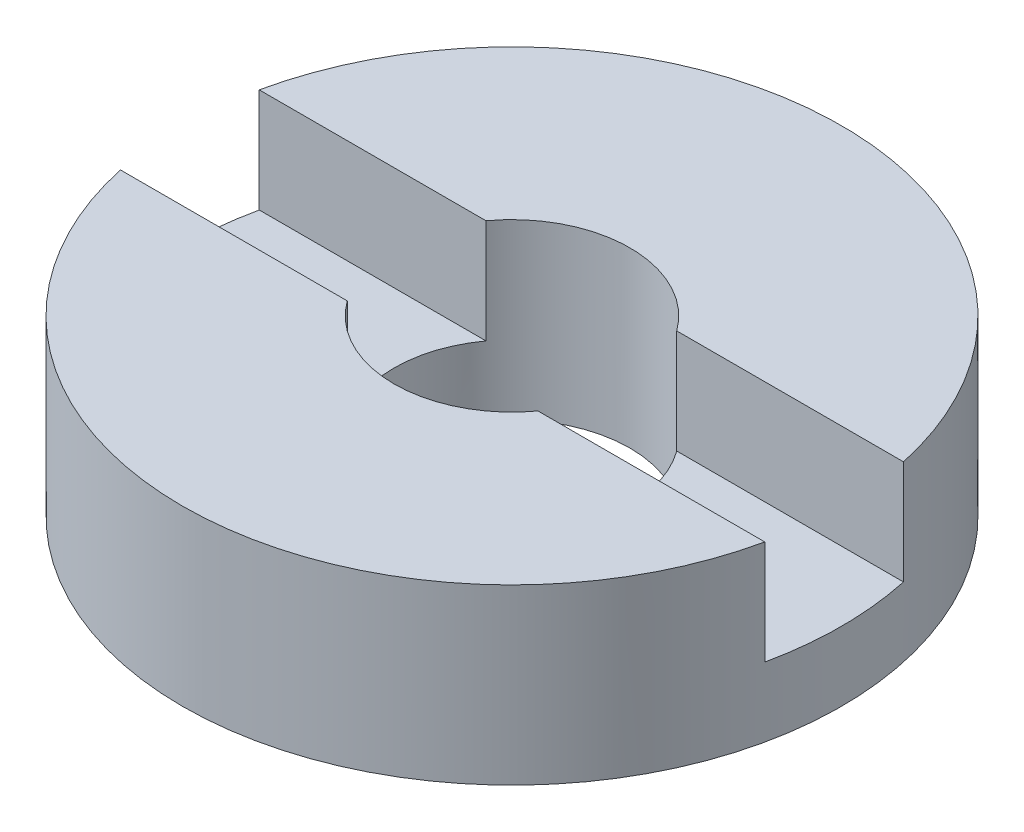
ISO-10303-21;
HEADER;
FILE_DESCRIPTION(('STEP AP214'),'2;1');
FILE_NAME('part.step','',(''),(''),'','','');
FILE_SCHEMA(('AUTOMOTIVE_DESIGN { 1 0 10303 214 1 1 1 1 }'));
ENDSEC;
DATA;
#1=APPLICATION_CONTEXT('core data for automotive mechanical design processes');
#2=APPLICATION_PROTOCOL_DEFINITION('international standard','automotive_design',2000,#1);
#3=PRODUCT_CONTEXT('',#1,'mechanical');
#4=PRODUCT('Part','Part','',(#3));
#5=PRODUCT_RELATED_PRODUCT_CATEGORY('part','',(#4));
#6=PRODUCT_DEFINITION_FORMATION('','',#4);
#7=PRODUCT_DEFINITION_CONTEXT('part definition',#1,'design');
#8=PRODUCT_DEFINITION('design','',#6,#7);
#9=PRODUCT_DEFINITION_SHAPE('','',#8);
#10=(LENGTH_UNIT() NAMED_UNIT(*) SI_UNIT(.MILLI.,.METRE.));
#11=(NAMED_UNIT(*) PLANE_ANGLE_UNIT() SI_UNIT($,.RADIAN.));
#12=(NAMED_UNIT(*) SI_UNIT($,.STERADIAN.) SOLID_ANGLE_UNIT());
#13=UNCERTAINTY_MEASURE_WITH_UNIT(LENGTH_MEASURE(1.E-05),#10,'distance_accuracy_value','');
#14=(GEOMETRIC_REPRESENTATION_CONTEXT(3) GLOBAL_UNCERTAINTY_ASSIGNED_CONTEXT((#13)) GLOBAL_UNIT_ASSIGNED_CONTEXT((#10,
#11,#12)) REPRESENTATION_CONTEXT('',''));
#15=CARTESIAN_POINT('',(0.,0.,0.));
#16=DIRECTION('',(0.,0.,1.));
#17=DIRECTION('',(1.,0.,0.));
#18=AXIS2_PLACEMENT_3D('',#15,#16,#17);
#19=CARTESIAN_POINT('',(1.70000000000001,-1.96424978717943,0.));
#20=DIRECTION('',(0.,-1.,0.));
#21=DIRECTION('',(0.,0.,-1.));
#22=AXIS2_PLACEMENT_3D('',#19,#20,#21);
#23=PLANE('',#22);
#24=CARTESIAN_POINT('',(0.,-1.96424978717943,0.));
#25=DIRECTION('',(0.,1.,0.));
#26=DIRECTION('',(0.,0.,1.));
#27=AXIS2_PLACEMENT_3D('',#24,#25,#26);
#28=CIRCLE('',#27,4.75000000000001);
#29=CARTESIAN_POINT('',(-4.64354390525169,-1.96424978717943,1.));
#30=VERTEX_POINT('',#29);
#31=CARTESIAN_POINT('',(4.64354390525167,-1.96424978717943,1.));
#32=VERTEX_POINT('',#31);
#33=EDGE_CURVE('E125',#30,#32,#28,.T.);
#34=ORIENTED_EDGE('',*,*,#33,.T.);
#35=DIRECTION('',(1.,0.,0.));
#36=VECTOR('',#35,1.);
#37=CARTESIAN_POINT('',(-26.8525402726146,-1.96424978717943,1.));
#38=LINE('',#37,#36);
#39=CARTESIAN_POINT('',(1.37477270848676,-1.96424978717943,1.));
#40=VERTEX_POINT('',#39);
#41=EDGE_CURVE('E118',#40,#32,#38,.T.);
#42=ORIENTED_EDGE('',*,*,#41,.F.);
#43=CARTESIAN_POINT('',(0.,-1.96424978717943,0.));
#44=DIRECTION('',(0.,1.,0.));
#45=DIRECTION('',(0.,0.,1.));
#46=AXIS2_PLACEMENT_3D('',#43,#44,#45);
#47=CIRCLE('',#46,1.70000000000001);
#48=CARTESIAN_POINT('',(-1.37477270848676,-1.96424978717943,1.));
#49=VERTEX_POINT('',#48);
#50=EDGE_CURVE('E132',#49,#40,#47,.T.);
#51=ORIENTED_EDGE('',*,*,#50,.F.);
#52=EDGE_CURVE('E147',#30,#49,#38,.T.);
#53=ORIENTED_EDGE('',*,*,#52,.F.);
#54=EDGE_LOOP('',(#34,#42,#51,#53));
#55=FACE_BOUND('',#54,.T.);
#56=ADVANCED_FACE('F35',(#55),#23,.F.);
#57=CARTESIAN_POINT('',(0.,56.2608426270136,0.));
#58=DIRECTION('',(0.,1.,0.));
#59=DIRECTION('',(0.,0.,1.));
#60=AXIS2_PLACEMENT_3D('',#57,#58,#59);
#61=CYLINDRICAL_SURFACE('',#60,4.75000000000001);
#62=CARTESIAN_POINT('',(0.,-3.46424978717943,0.));
#63=DIRECTION('',(0.,1.,0.));
#64=DIRECTION('',(0.,0.,1.));
#65=AXIS2_PLACEMENT_3D('',#62,#63,#64);
#66=CIRCLE('',#65,4.75000000000001);
#67=CARTESIAN_POINT('',(4.64354390525168,-3.46424978717943,1.));
#68=VERTEX_POINT('',#67);
#69=CARTESIAN_POINT('',(4.64354390525168,-3.46424978717943,-1.));
#70=VERTEX_POINT('',#69);
#71=EDGE_CURVE('E108',#68,#70,#66,.T.);
#72=ORIENTED_EDGE('',*,*,#71,.F.);
#73=DIRECTION('',(0.,1.,0.));
#74=VECTOR('',#73,1.);
#75=CARTESIAN_POINT('',(4.64354390525169,56.2608426270136,1.));
#76=LINE('',#75,#74);
#77=EDGE_CURVE('E160',#68,#32,#76,.T.);
#78=ORIENTED_EDGE('',*,*,#77,.T.);
#79=ORIENTED_EDGE('',*,*,#33,.F.);
#80=DIRECTION('',(0.,1.,0.));
#81=VECTOR('',#80,1.);
#82=CARTESIAN_POINT('',(-4.64354390525169,56.2608426270136,1.));
#83=LINE('',#82,#81);
#84=CARTESIAN_POINT('',(-4.64354390525168,-3.46424978717943,1.));
#85=VERTEX_POINT('',#84);
#86=EDGE_CURVE('E157',#30,#85,#83,.F.);
#87=ORIENTED_EDGE('',*,*,#86,.T.);
#88=CARTESIAN_POINT('',(-4.64354390525168,-3.46424978717943,-1.));
#89=VERTEX_POINT('',#88);
#90=EDGE_CURVE('E154',#89,#85,#66,.T.);
#91=ORIENTED_EDGE('',*,*,#90,.F.);
#92=DIRECTION('',(0.,1.,0.));
#93=VECTOR('',#92,1.);
#94=CARTESIAN_POINT('',(-4.64354390525169,56.2608426270136,-1.));
#95=LINE('',#94,#93);
#96=CARTESIAN_POINT('',(-4.64354390525169,-1.96424978717943,-1.));
#97=VERTEX_POINT('',#96);
#98=EDGE_CURVE('E107',#89,#97,#95,.T.);
#99=ORIENTED_EDGE('',*,*,#98,.T.);
#100=CARTESIAN_POINT('',(4.64354390525167,-1.96424978717943,-1.));
#101=VERTEX_POINT('',#100);
#102=EDGE_CURVE('E115',#101,#97,#28,.T.);
#103=ORIENTED_EDGE('',*,*,#102,.F.);
#104=DIRECTION('',(0.,1.,0.));
#105=VECTOR('',#104,1.);
#106=CARTESIAN_POINT('',(4.64354390525169,56.2608426270136,-1.));
#107=LINE('',#106,#105);
#108=EDGE_CURVE('E99',#101,#70,#107,.F.);
#109=ORIENTED_EDGE('',*,*,#108,.T.);
#110=EDGE_LOOP('',(#72,#78,#79,#87,#91,#99,#103,#109));
#111=FACE_BOUND('',#110,.T.);
#112=CARTESIAN_POINT('',(0.,-4.46424978717943,0.));
#113=DIRECTION('',(0.,1.,0.));
#114=DIRECTION('',(0.,0.,1.));
#115=AXIS2_PLACEMENT_3D('',#112,#113,#114);
#116=CIRCLE('',#115,4.75000000000001);
#117=CARTESIAN_POINT('',(0.,-4.46424978717943,4.75000000000001));
#118=VERTEX_POINT('',#117);
#119=EDGE_CURVE('E163',#118,#118,#116,.T.);
#120=ORIENTED_EDGE('',*,*,#119,.T.);
#121=EDGE_LOOP('',(#120));
#122=FACE_BOUND('',#121,.T.);
#123=ADVANCED_FACE('F37',(#111,#122),#61,.T.);
#124=ORIENTED_EDGE('',*,*,#102,.T.);
#125=DIRECTION('',(-1.,0.,0.));
#126=VECTOR('',#125,1.);
#127=CARTESIAN_POINT('',(-26.8525402726146,-1.96424978717943,-1.));
#128=LINE('',#127,#126);
#129=CARTESIAN_POINT('',(-1.37477270848676,-1.96424978717943,-1.));
#130=VERTEX_POINT('',#129);
#131=EDGE_CURVE('E119',#130,#97,#128,.T.);
#132=ORIENTED_EDGE('',*,*,#131,.F.);
#133=CARTESIAN_POINT('',(1.37477270848676,-1.96424978717943,-1.));
#134=VERTEX_POINT('',#133);
#135=EDGE_CURVE('E117',#134,#130,#47,.T.);
#136=ORIENTED_EDGE('',*,*,#135,.F.);
#137=EDGE_CURVE('E102',#101,#134,#128,.T.);
#138=ORIENTED_EDGE('',*,*,#137,.F.);
#139=EDGE_LOOP('',(#124,#132,#136,#138));
#140=FACE_BOUND('',#139,.T.);
#141=ADVANCED_FACE('F113',(#140),#23,.F.);
#142=CARTESIAN_POINT('',(0.,56.2608426270136,0.));
#143=DIRECTION('',(0.,1.,0.));
#144=DIRECTION('',(0.,0.,1.));
#145=AXIS2_PLACEMENT_3D('',#142,#143,#144);
#146=CYLINDRICAL_SURFACE('',#145,1.70000000000001);
#147=CARTESIAN_POINT('',(0.,-3.46424978717943,0.));
#148=DIRECTION('',(0.,1.,0.));
#149=DIRECTION('',(0.,0.,1.));
#150=AXIS2_PLACEMENT_3D('',#147,#148,#149);
#151=CIRCLE('',#150,1.70000000000001);
#152=CARTESIAN_POINT('',(-1.37477270848676,-3.46424978717943,1.));
#153=VERTEX_POINT('',#152);
#154=CARTESIAN_POINT('',(-1.37477270848676,-3.46424978717943,-1.));
#155=VERTEX_POINT('',#154);
#156=EDGE_CURVE('E129',#153,#155,#151,.F.);
#157=ORIENTED_EDGE('',*,*,#156,.F.);
#158=DIRECTION('',(0.,1.,0.));
#159=VECTOR('',#158,1.);
#160=CARTESIAN_POINT('',(-1.37477270848676,56.2608426270136,1.));
#161=LINE('',#160,#159);
#162=EDGE_CURVE('E11',#153,#49,#161,.T.);
#163=ORIENTED_EDGE('',*,*,#162,.T.);
#164=ORIENTED_EDGE('',*,*,#50,.T.);
#165=DIRECTION('',(0.,1.,0.));
#166=VECTOR('',#165,1.);
#167=CARTESIAN_POINT('',(1.37477270848676,56.2608426270136,1.));
#168=LINE('',#167,#166);
#169=CARTESIAN_POINT('',(1.37477270848676,-3.46424978717943,1.));
#170=VERTEX_POINT('',#169);
#171=EDGE_CURVE('E136',#40,#170,#168,.F.);
#172=ORIENTED_EDGE('',*,*,#171,.T.);
#173=CARTESIAN_POINT('',(1.37477270848676,-3.46424978717943,-1.));
#174=VERTEX_POINT('',#173);
#175=EDGE_CURVE('E124',#174,#170,#151,.F.);
#176=ORIENTED_EDGE('',*,*,#175,.F.);
#177=DIRECTION('',(0.,1.,0.));
#178=VECTOR('',#177,1.);
#179=CARTESIAN_POINT('',(1.37477270848676,56.2608426270136,-1.));
#180=LINE('',#179,#178);
#181=EDGE_CURVE('E127',#174,#134,#180,.T.);
#182=ORIENTED_EDGE('',*,*,#181,.T.);
#183=ORIENTED_EDGE('',*,*,#135,.T.);
#184=DIRECTION('',(0.,1.,0.));
#185=VECTOR('',#184,1.);
#186=CARTESIAN_POINT('',(-1.37477270848676,56.2608426270136,-1.));
#187=LINE('',#186,#185);
#188=EDGE_CURVE('E43',#130,#155,#187,.F.);
#189=ORIENTED_EDGE('',*,*,#188,.T.);
#190=EDGE_LOOP('',(#157,#163,#164,#172,#176,#182,#183,#189));
#191=FACE_BOUND('',#190,.T.);
#192=CARTESIAN_POINT('',(0.,-4.46424978717943,0.));
#193=DIRECTION('',(0.,1.,0.));
#194=DIRECTION('',(0.,0.,1.));
#195=AXIS2_PLACEMENT_3D('',#192,#193,#194);
#196=CIRCLE('',#195,1.70000000000001);
#197=CARTESIAN_POINT('',(0.,-4.46424978717943,1.70000000000001));
#198=VERTEX_POINT('',#197);
#199=EDGE_CURVE('E165',#198,#198,#196,.T.);
#200=ORIENTED_EDGE('',*,*,#199,.F.);
#201=EDGE_LOOP('',(#200));
#202=FACE_BOUND('',#201,.T.);
#203=ADVANCED_FACE('F171',(#191,#202),#146,.F.);
#204=CARTESIAN_POINT('',(1.70000000000001,-4.46424978717943,0.));
#205=DIRECTION('',(0.,1.,0.));
#206=DIRECTION('',(0.,0.,1.));
#207=AXIS2_PLACEMENT_3D('',#204,#205,#206);
#208=PLANE('',#207);
#209=ORIENTED_EDGE('',*,*,#119,.F.);
#210=EDGE_LOOP('',(#209));
#211=FACE_BOUND('',#210,.T.);
#212=ORIENTED_EDGE('',*,*,#199,.T.);
#213=EDGE_LOOP('',(#212));
#214=FACE_BOUND('',#213,.T.);
#215=ADVANCED_FACE('F201',(#211,#214),#208,.F.);
#216=CARTESIAN_POINT('',(0.,-3.46424978717943,0.));
#217=DIRECTION('',(0.,1.,0.));
#218=DIRECTION('',(0.,0.,1.));
#219=AXIS2_PLACEMENT_3D('',#216,#217,#218);
#220=PLANE('',#219);
#221=ORIENTED_EDGE('',*,*,#71,.T.);
#222=DIRECTION('',(-1.,0.,0.));
#223=VECTOR('',#222,1.);
#224=CARTESIAN_POINT('',(-26.8525402726146,-3.46424978717943,-1.));
#225=LINE('',#224,#223);
#226=EDGE_CURVE('E58',#70,#174,#225,.T.);
#227=ORIENTED_EDGE('',*,*,#226,.T.);
#228=ORIENTED_EDGE('',*,*,#175,.T.);
#229=DIRECTION('',(1.,0.,0.));
#230=VECTOR('',#229,1.);
#231=CARTESIAN_POINT('',(-26.8525402726146,-3.46424978717943,1.));
#232=LINE('',#231,#230);
#233=EDGE_CURVE('E149',#170,#68,#232,.T.);
#234=ORIENTED_EDGE('',*,*,#233,.T.);
#235=EDGE_LOOP('',(#221,#227,#228,#234));
#236=FACE_BOUND('',#235,.T.);
#237=ADVANCED_FACE('F175',(#236),#220,.T.);
#238=CARTESIAN_POINT('',(-26.8525402726146,-3.46424978717943,-1.));
#239=DIRECTION('',(0.,0.,-1.));
#240=DIRECTION('',(-1.,0.,0.));
#241=AXIS2_PLACEMENT_3D('',#238,#239,#240);
#242=PLANE('',#241);
#243=ORIENTED_EDGE('',*,*,#137,.T.);
#244=ORIENTED_EDGE('',*,*,#181,.F.);
#245=ORIENTED_EDGE('',*,*,#226,.F.);
#246=ORIENTED_EDGE('',*,*,#108,.F.);
#247=EDGE_LOOP('',(#243,#244,#245,#246));
#248=FACE_BOUND('',#247,.T.);
#249=ADVANCED_FACE('F101',(#248),#242,.F.);
#250=CARTESIAN_POINT('',(-26.8525402726146,-3.46424978717943,1.));
#251=DIRECTION('',(0.,0.,1.));
#252=DIRECTION('',(1.,0.,0.));
#253=AXIS2_PLACEMENT_3D('',#250,#251,#252);
#254=PLANE('',#253);
#255=ORIENTED_EDGE('',*,*,#233,.F.);
#256=ORIENTED_EDGE('',*,*,#171,.F.);
#257=ORIENTED_EDGE('',*,*,#41,.T.);
#258=ORIENTED_EDGE('',*,*,#77,.F.);
#259=EDGE_LOOP('',(#255,#256,#257,#258));
#260=FACE_BOUND('',#259,.T.);
#261=ADVANCED_FACE('F177',(#260),#254,.F.);
#262=ORIENTED_EDGE('',*,*,#52,.T.);
#263=ORIENTED_EDGE('',*,*,#162,.F.);
#264=EDGE_CURVE('E50',#85,#153,#232,.T.);
#265=ORIENTED_EDGE('',*,*,#264,.F.);
#266=ORIENTED_EDGE('',*,*,#86,.F.);
#267=EDGE_LOOP('',(#262,#263,#265,#266));
#268=FACE_BOUND('',#267,.T.);
#269=ADVANCED_FACE('F183',(#268),#254,.F.);
#270=EDGE_CURVE('E144',#155,#89,#225,.T.);
#271=ORIENTED_EDGE('',*,*,#270,.F.);
#272=ORIENTED_EDGE('',*,*,#188,.F.);
#273=ORIENTED_EDGE('',*,*,#131,.T.);
#274=ORIENTED_EDGE('',*,*,#98,.F.);
#275=EDGE_LOOP('',(#271,#272,#273,#274));
#276=FACE_BOUND('',#275,.T.);
#277=ADVANCED_FACE('F146',(#276),#242,.F.);
#278=ORIENTED_EDGE('',*,*,#90,.T.);
#279=ORIENTED_EDGE('',*,*,#264,.T.);
#280=ORIENTED_EDGE('',*,*,#156,.T.);
#281=ORIENTED_EDGE('',*,*,#270,.T.);
#282=EDGE_LOOP('',(#278,#279,#280,#281));
#283=FACE_BOUND('',#282,.T.);
#284=ADVANCED_FACE('F143',(#283),#220,.T.);
#285=CLOSED_SHELL('',(#56,#123,#141,#203,#215,#237,#249,#261,#269,#277,#284));
#286=MANIFOLD_SOLID_BREP('B2',#285);
#287=ADVANCED_BREP_SHAPE_REPRESENTATION('',(#18,#286),#14);
#288=SHAPE_DEFINITION_REPRESENTATION(#9,#287);
ENDSEC;
END-ISO-10303-21;
